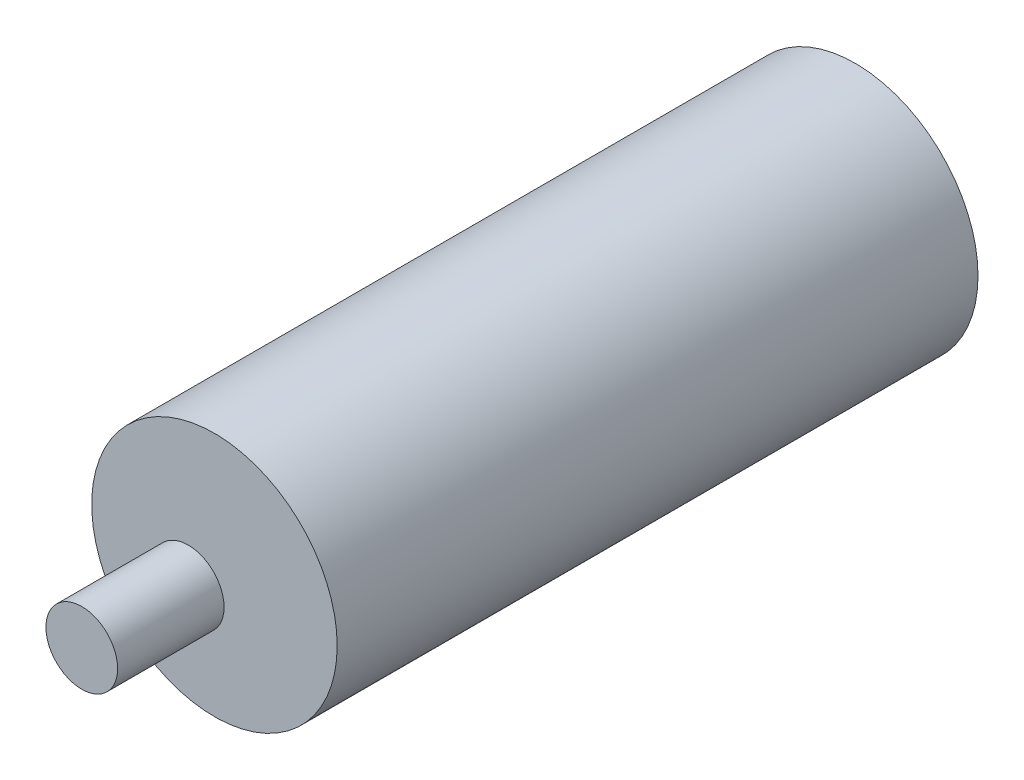
ISO-10303-21;
HEADER;
FILE_DESCRIPTION(('STEP AP214'),'2;1');
FILE_NAME('part.step','',(''),(''),'','','');
FILE_SCHEMA(('AUTOMOTIVE_DESIGN { 1 0 10303 214 1 1 1 1 }'));
ENDSEC;
DATA;
#1=APPLICATION_CONTEXT('core data for automotive mechanical design processes');
#2=APPLICATION_PROTOCOL_DEFINITION('international standard','automotive_design',2000,#1);
#3=PRODUCT_CONTEXT('',#1,'mechanical');
#4=PRODUCT('Part','Part','',(#3));
#5=PRODUCT_RELATED_PRODUCT_CATEGORY('part','',(#4));
#6=PRODUCT_DEFINITION_FORMATION('','',#4);
#7=PRODUCT_DEFINITION_CONTEXT('part definition',#1,'design');
#8=PRODUCT_DEFINITION('design','',#6,#7);
#9=PRODUCT_DEFINITION_SHAPE('','',#8);
#10=(LENGTH_UNIT() NAMED_UNIT(*) SI_UNIT(.MILLI.,.METRE.));
#11=(NAMED_UNIT(*) PLANE_ANGLE_UNIT() SI_UNIT($,.RADIAN.));
#12=(NAMED_UNIT(*) SI_UNIT($,.STERADIAN.) SOLID_ANGLE_UNIT());
#13=UNCERTAINTY_MEASURE_WITH_UNIT(LENGTH_MEASURE(1.E-05),#10,'distance_accuracy_value','');
#14=(GEOMETRIC_REPRESENTATION_CONTEXT(3) GLOBAL_UNCERTAINTY_ASSIGNED_CONTEXT((#13)) GLOBAL_UNIT_ASSIGNED_CONTEXT((#10,
#11,#12)) REPRESENTATION_CONTEXT('',''));
#15=CARTESIAN_POINT('',(0.,0.,0.));
#16=DIRECTION('',(0.,0.,1.));
#17=DIRECTION('',(1.,0.,0.));
#18=AXIS2_PLACEMENT_3D('',#15,#16,#17);
#19=CARTESIAN_POINT('',(0.,0.,149.86));
#20=DIRECTION('',(0.,0.,-1.));
#21=DIRECTION('',(-1.,0.,0.));
#22=AXIS2_PLACEMENT_3D('',#19,#20,#21);
#23=CYLINDRICAL_SURFACE('',#22,28.702);
#24=CARTESIAN_POINT('',(0.,0.,149.86));
#25=DIRECTION('',(0.,0.,1.));
#26=DIRECTION('',(1.,0.,0.));
#27=AXIS2_PLACEMENT_3D('',#24,#25,#26);
#28=CIRCLE('',#27,28.702);
#29=CARTESIAN_POINT('',(28.702,0.,149.86));
#30=VERTEX_POINT('',#29);
#31=EDGE_CURVE('E40',#30,#30,#28,.T.);
#32=ORIENTED_EDGE('',*,*,#31,.F.);
#33=EDGE_LOOP('',(#32));
#34=FACE_BOUND('',#33,.T.);
#35=CARTESIAN_POINT('',(0.,0.,0.));
#36=DIRECTION('',(0.,0.,1.));
#37=DIRECTION('',(1.,0.,0.));
#38=AXIS2_PLACEMENT_3D('',#35,#36,#37);
#39=CIRCLE('',#38,28.702);
#40=CARTESIAN_POINT('',(28.702,0.,0.));
#41=VERTEX_POINT('',#40);
#42=EDGE_CURVE('E36',#41,#41,#39,.T.);
#43=ORIENTED_EDGE('',*,*,#42,.T.);
#44=EDGE_LOOP('',(#43));
#45=FACE_BOUND('',#44,.T.);
#46=ADVANCED_FACE('F33',(#34,#45),#23,.T.);
#47=CARTESIAN_POINT('',(0.,0.,149.86));
#48=DIRECTION('',(0.,0.,1.));
#49=DIRECTION('',(1.,0.,0.));
#50=AXIS2_PLACEMENT_3D('',#47,#48,#49);
#51=PLANE('',#50);
#52=CARTESIAN_POINT('',(-6.13207271635845,-5.38545481488237,149.86));
#53=DIRECTION('',(0.,0.,1.));
#54=DIRECTION('',(1.,0.,0.));
#55=AXIS2_PLACEMENT_3D('',#52,#53,#54);
#56=CIRCLE('',#55,8.382);
#57=CARTESIAN_POINT('',(2.24992728364155,-5.38545481488237,149.86));
#58=VERTEX_POINT('',#57);
#59=EDGE_CURVE('E10',#58,#58,#56,.T.);
#60=ORIENTED_EDGE('',*,*,#59,.F.);
#61=EDGE_LOOP('',(#60));
#62=FACE_BOUND('',#61,.T.);
#63=ORIENTED_EDGE('',*,*,#31,.T.);
#64=EDGE_LOOP('',(#63));
#65=FACE_BOUND('',#64,.T.);
#66=ADVANCED_FACE('F57',(#62,#65),#51,.T.);
#67=CARTESIAN_POINT('',(0.,0.,0.));
#68=DIRECTION('',(0.,0.,1.));
#69=DIRECTION('',(1.,0.,0.));
#70=AXIS2_PLACEMENT_3D('',#67,#68,#69);
#71=PLANE('',#70);
#72=ORIENTED_EDGE('',*,*,#42,.F.);
#73=EDGE_LOOP('',(#72));
#74=FACE_BOUND('',#73,.T.);
#75=ADVANCED_FACE('F54',(#74),#71,.F.);
#76=CARTESIAN_POINT('',(-6.13207271635845,-5.38545481488237,174.752));
#77=DIRECTION('',(0.,0.,-1.));
#78=DIRECTION('',(-1.,0.,0.));
#79=AXIS2_PLACEMENT_3D('',#76,#77,#78);
#80=CYLINDRICAL_SURFACE('',#79,8.382);
#81=CARTESIAN_POINT('',(-6.13207271635845,-5.38545481488237,174.752));
#82=DIRECTION('',(0.,0.,1.));
#83=DIRECTION('',(1.,0.,0.));
#84=AXIS2_PLACEMENT_3D('',#81,#82,#83);
#85=CIRCLE('',#84,8.382);
#86=CARTESIAN_POINT('',(2.24992728364155,-5.38545481488237,174.752));
#87=VERTEX_POINT('',#86);
#88=EDGE_CURVE('E46',#87,#87,#85,.T.);
#89=ORIENTED_EDGE('',*,*,#88,.F.);
#90=EDGE_LOOP('',(#89));
#91=FACE_BOUND('',#90,.T.);
#92=ORIENTED_EDGE('',*,*,#59,.T.);
#93=EDGE_LOOP('',(#92));
#94=FACE_BOUND('',#93,.T.);
#95=ADVANCED_FACE('F56',(#91,#94),#80,.T.);
#96=CARTESIAN_POINT('',(-6.13207271635845,-5.38545481488237,174.752));
#97=DIRECTION('',(0.,0.,1.));
#98=DIRECTION('',(1.,0.,0.));
#99=AXIS2_PLACEMENT_3D('',#96,#97,#98);
#100=PLANE('',#99);
#101=ORIENTED_EDGE('',*,*,#88,.T.);
#102=EDGE_LOOP('',(#101));
#103=FACE_BOUND('',#102,.T.);
#104=ADVANCED_FACE('F62',(#103),#100,.T.);
#105=CLOSED_SHELL('',(#46,#66,#75,#95,#104));
#106=MANIFOLD_SOLID_BREP('B2',#105);
#107=ADVANCED_BREP_SHAPE_REPRESENTATION('',(#18,#106),#14);
#108=SHAPE_DEFINITION_REPRESENTATION(#9,#107);
ENDSEC;
END-ISO-10303-21;
